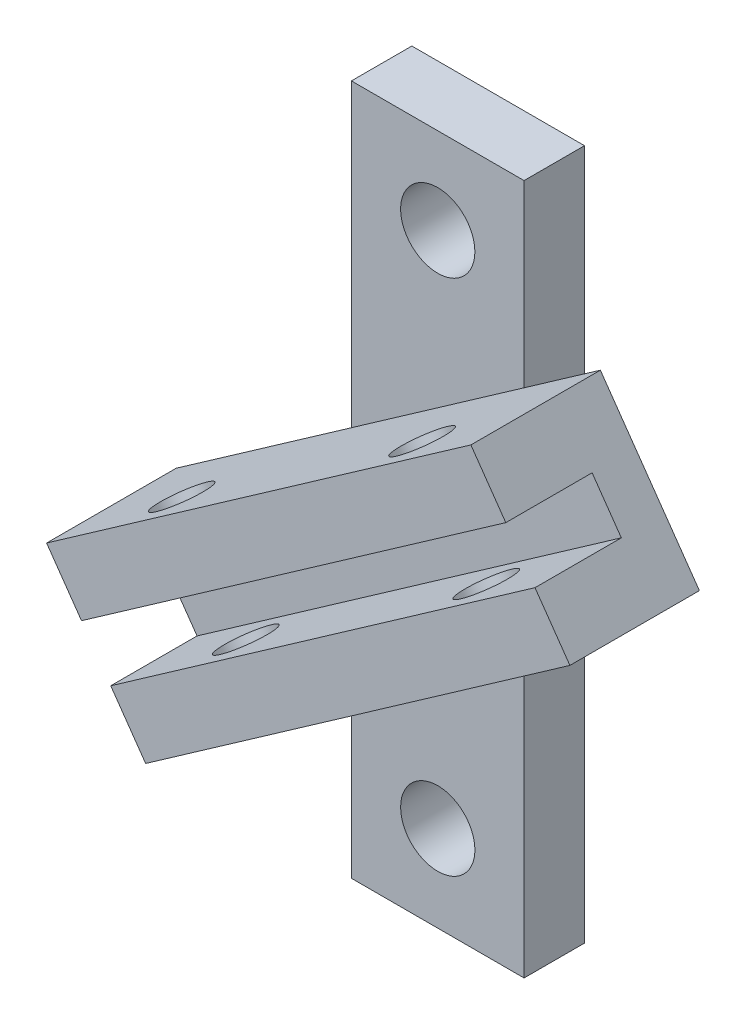
ISO-10303-21;
HEADER;
FILE_DESCRIPTION(('STEP AP214'),'2;1');
FILE_NAME('part.step','',(''),(''),'','','');
FILE_SCHEMA(('AUTOMOTIVE_DESIGN { 1 0 10303 214 1 1 1 1 }'));
ENDSEC;
DATA;
#1=APPLICATION_CONTEXT('core data for automotive mechanical design processes');
#2=APPLICATION_PROTOCOL_DEFINITION('international standard','automotive_design',2000,#1);
#3=PRODUCT_CONTEXT('',#1,'mechanical');
#4=PRODUCT('Part','Part','',(#3));
#5=PRODUCT_RELATED_PRODUCT_CATEGORY('part','',(#4));
#6=PRODUCT_DEFINITION_FORMATION('','',#4);
#7=PRODUCT_DEFINITION_CONTEXT('part definition',#1,'design');
#8=PRODUCT_DEFINITION('design','',#6,#7);
#9=PRODUCT_DEFINITION_SHAPE('','',#8);
#10=(LENGTH_UNIT() NAMED_UNIT(*) SI_UNIT(.MILLI.,.METRE.));
#11=(NAMED_UNIT(*) PLANE_ANGLE_UNIT() SI_UNIT($,.RADIAN.));
#12=(NAMED_UNIT(*) SI_UNIT($,.STERADIAN.) SOLID_ANGLE_UNIT());
#13=UNCERTAINTY_MEASURE_WITH_UNIT(LENGTH_MEASURE(1.E-05),#10,'distance_accuracy_value','');
#14=(GEOMETRIC_REPRESENTATION_CONTEXT(3) GLOBAL_UNCERTAINTY_ASSIGNED_CONTEXT((#13)) GLOBAL_UNIT_ASSIGNED_CONTEXT((#10,
#11,#12)) REPRESENTATION_CONTEXT('',''));
#15=CARTESIAN_POINT('',(0.,0.,0.));
#16=DIRECTION('',(0.,0.,1.));
#17=DIRECTION('',(1.,0.,0.));
#18=AXIS2_PLACEMENT_3D('',#15,#16,#17);
#19=CARTESIAN_POINT('',(0.,0.,22.));
#20=DIRECTION('',(0.,0.,1.));
#21=DIRECTION('',(1.,0.,0.));
#22=AXIS2_PLACEMENT_3D('',#19,#20,#21);
#23=PLANE('',#22);
#24=DIRECTION('',(-0.819152044288995,-0.573576436351042,0.));
#25=VECTOR('',#24,1.);
#26=CARTESIAN_POINT('',(32.8825108414343,59.6237916211837,22.));
#27=LINE('',#26,#25);
#28=CARTESIAN_POINT('',(32.8825108414343,59.6237916211837,22.));
#29=VERTEX_POINT('',#28);
#30=CARTESIAN_POINT('',(-16.2666118159054,25.2092054401212,22.));
#31=VERTEX_POINT('',#30);
#32=EDGE_CURVE('E154',#29,#31,#27,.T.);
#33=ORIENTED_EDGE('',*,*,#32,.F.);
#34=DIRECTION('',(-0.573576436351042,0.819152044288995,0.));
#35=VECTOR('',#34,1.);
#36=CARTESIAN_POINT('',(50.0785144610163,35.0653533279472,22.));
#37=LINE('',#36,#35);
#38=CARTESIAN_POINT('',(28.8387969651595,65.3988135334211,22.));
#39=VERTEX_POINT('',#38);
#40=EDGE_CURVE('E175',#29,#39,#37,.T.);
#41=ORIENTED_EDGE('',*,*,#40,.T.);
#42=DIRECTION('',(-0.819152044288995,-0.573576436351042,0.));
#43=VECTOR('',#42,1.);
#44=CARTESIAN_POINT('',(-21.2397174958569,30.3334602054739,22.));
#45=LINE('',#44,#43);
#46=CARTESIAN_POINT('',(-20.3103256921802,30.9842273523586,22.));
#47=VERTEX_POINT('',#46);
#48=EDGE_CURVE('E166',#39,#47,#45,.T.);
#49=ORIENTED_EDGE('',*,*,#48,.T.);
#50=DIRECTION('',(0.573576436351042,-0.819152044288995,0.));
#51=VECTOR('',#50,1.);
#52=CARTESIAN_POINT('',(0.929391803676648,0.650767146884701,22.));
#53=LINE('',#52,#51);
#54=EDGE_CURVE('E170',#47,#31,#53,.T.);
#55=ORIENTED_EDGE('',*,*,#54,.T.);
#56=EDGE_LOOP('',(#33,#41,#49,#55));
#57=FACE_BOUND('',#56,.T.);
#58=ADVANCED_FACE('F35',(#57),#23,.T.);
#59=CARTESIAN_POINT('',(0.,0.,7.));
#60=DIRECTION('',(0.,0.,-1.));
#61=DIRECTION('',(-1.,0.,0.));
#62=AXIS2_PLACEMENT_3D('',#59,#60,#61);
#63=PLANE('',#62);
#64=CARTESIAN_POINT('',(9.99999999999999,70.,7.));
#65=DIRECTION('',(0.,0.,1.));
#66=DIRECTION('',(1.,0.,0.));
#67=AXIS2_PLACEMENT_3D('',#64,#65,#66);
#68=CIRCLE('',#67,4.3);
#69=CARTESIAN_POINT('',(14.3,70.,7.));
#70=VERTEX_POINT('',#69);
#71=EDGE_CURVE('E206',#70,#70,#68,.T.);
#72=ORIENTED_EDGE('',*,*,#71,.F.);
#73=EDGE_LOOP('',(#72));
#74=FACE_BOUND('',#73,.T.);
#75=DIRECTION('',(-0.819152044288995,-0.573576436351042,0.));
#76=VECTOR('',#75,1.);
#77=CARTESIAN_POINT('',(-21.2397174958569,30.3334602054739,7.));
#78=LINE('',#77,#76);
#79=CARTESIAN_POINT('',(20.,59.2098212697114,7.));
#80=VERTEX_POINT('',#79);
#81=CARTESIAN_POINT('',(0.,45.2056705055174,7.));
#82=VERTEX_POINT('',#81);
#83=EDGE_CURVE('E11',#80,#82,#78,.T.);
#84=ORIENTED_EDGE('',*,*,#83,.F.);
#85=DIRECTION('',(0.,1.,0.));
#86=VECTOR('',#85,1.);
#87=CARTESIAN_POINT('',(20.,0.,7.));
#88=LINE('',#87,#86);
#89=CARTESIAN_POINT('',(20.,80.,7.));
#90=VERTEX_POINT('',#89);
#91=EDGE_CURVE('E218',#80,#90,#88,.T.);
#92=ORIENTED_EDGE('',*,*,#91,.T.);
#93=DIRECTION('',(-1.,0.,0.));
#94=VECTOR('',#93,1.);
#95=CARTESIAN_POINT('',(0.,80.,7.));
#96=LINE('',#95,#94);
#97=CARTESIAN_POINT('',(0.,80.,7.));
#98=VERTEX_POINT('',#97);
#99=EDGE_CURVE('E221',#90,#98,#96,.T.);
#100=ORIENTED_EDGE('',*,*,#99,.T.);
#101=DIRECTION('',(0.,-1.,0.));
#102=VECTOR('',#101,1.);
#103=CARTESIAN_POINT('',(0.,0.,7.));
#104=LINE('',#103,#102);
#105=EDGE_CURVE('E212',#98,#82,#104,.T.);
#106=ORIENTED_EDGE('',*,*,#105,.T.);
#107=EDGE_LOOP('',(#84,#92,#100,#106));
#108=FACE_BOUND('',#107,.T.);
#109=ADVANCED_FACE('F327',(#74,#108),#63,.F.);
#110=CARTESIAN_POINT('',(10.,9.99999999999999,7.));
#111=DIRECTION('',(0.,0.,1.));
#112=DIRECTION('',(-1.,0.,0.));
#113=AXIS2_PLACEMENT_3D('',#110,#111,#112);
#114=CIRCLE('',#113,4.3);
#115=CARTESIAN_POINT('',(5.70000000000001,9.99999999999999,7.));
#116=VERTEX_POINT('',#115);
#117=EDGE_CURVE('E200',#116,#116,#114,.T.);
#118=ORIENTED_EDGE('',*,*,#117,.F.);
#119=EDGE_LOOP('',(#118));
#120=FACE_BOUND('',#119,.T.);
#121=DIRECTION('',(0.819152044288995,0.573576436351042,0.));
#122=VECTOR('',#121,1.);
#123=CARTESIAN_POINT('',(-9.76818876883604,13.9504193196941,7.));
#124=LINE('',#123,#122);
#125=CARTESIAN_POINT('',(0.,20.7901787302884,7.));
#126=VERTEX_POINT('',#125);
#127=CARTESIAN_POINT('',(20.,34.7943294944824,7.));
#128=VERTEX_POINT('',#127);
#129=EDGE_CURVE('E44',#126,#128,#124,.T.);
#130=ORIENTED_EDGE('',*,*,#129,.F.);
#131=CARTESIAN_POINT('',(0.,0.,7.));
#132=VERTEX_POINT('',#131);
#133=EDGE_CURVE('E216',#126,#132,#104,.T.);
#134=ORIENTED_EDGE('',*,*,#133,.T.);
#135=DIRECTION('',(1.,0.,0.));
#136=VECTOR('',#135,1.);
#137=CARTESIAN_POINT('',(0.,0.,7.));
#138=LINE('',#137,#136);
#139=CARTESIAN_POINT('',(20.,0.,7.));
#140=VERTEX_POINT('',#139);
#141=EDGE_CURVE('E214',#132,#140,#138,.T.);
#142=ORIENTED_EDGE('',*,*,#141,.T.);
#143=EDGE_CURVE('E219',#140,#128,#88,.T.);
#144=ORIENTED_EDGE('',*,*,#143,.T.);
#145=EDGE_LOOP('',(#130,#134,#142,#144));
#146=FACE_BOUND('',#145,.T.);
#147=ADVANCED_FACE('F332',(#120,#146),#63,.F.);
#148=CARTESIAN_POINT('',(0.,0.,0.));
#149=DIRECTION('',(0.,0.,-1.));
#150=DIRECTION('',(-1.,0.,0.));
#151=AXIS2_PLACEMENT_3D('',#148,#149,#150);
#152=PLANE('',#151);
#153=CARTESIAN_POINT('',(9.99999999999999,70.,0.));
#154=DIRECTION('',(0.,0.,1.));
#155=DIRECTION('',(1.,0.,0.));
#156=AXIS2_PLACEMENT_3D('',#153,#154,#155);
#157=CIRCLE('',#156,4.3);
#158=CARTESIAN_POINT('',(14.3,70.,0.));
#159=VERTEX_POINT('',#158);
#160=EDGE_CURVE('E203',#159,#159,#157,.T.);
#161=ORIENTED_EDGE('',*,*,#160,.T.);
#162=EDGE_LOOP('',(#161));
#163=FACE_BOUND('',#162,.T.);
#164=DIRECTION('',(0.,-1.,0.));
#165=VECTOR('',#164,1.);
#166=CARTESIAN_POINT('',(0.,0.,0.));
#167=LINE('',#166,#165);
#168=CARTESIAN_POINT('',(0.,80.,0.));
#169=VERTEX_POINT('',#168);
#170=CARTESIAN_POINT('',(0.,0.,0.));
#171=VERTEX_POINT('',#170);
#172=EDGE_CURVE('E209',#169,#171,#167,.T.);
#173=ORIENTED_EDGE('',*,*,#172,.F.);
#174=DIRECTION('',(-1.,0.,0.));
#175=VECTOR('',#174,1.);
#176=CARTESIAN_POINT('',(0.,80.,0.));
#177=LINE('',#176,#175);
#178=CARTESIAN_POINT('',(20.,80.,0.));
#179=VERTEX_POINT('',#178);
#180=EDGE_CURVE('E231',#179,#169,#177,.T.);
#181=ORIENTED_EDGE('',*,*,#180,.F.);
#182=DIRECTION('',(0.,1.,0.));
#183=VECTOR('',#182,1.);
#184=CARTESIAN_POINT('',(20.,0.,0.));
#185=LINE('',#184,#183);
#186=CARTESIAN_POINT('',(20.,0.,0.));
#187=VERTEX_POINT('',#186);
#188=EDGE_CURVE('E229',#187,#179,#185,.T.);
#189=ORIENTED_EDGE('',*,*,#188,.F.);
#190=DIRECTION('',(1.,0.,0.));
#191=VECTOR('',#190,1.);
#192=CARTESIAN_POINT('',(0.,0.,0.));
#193=LINE('',#192,#191);
#194=EDGE_CURVE('E227',#171,#187,#193,.T.);
#195=ORIENTED_EDGE('',*,*,#194,.F.);
#196=EDGE_LOOP('',(#173,#181,#189,#195));
#197=FACE_BOUND('',#196,.T.);
#198=CARTESIAN_POINT('',(10.,9.99999999999999,0.));
#199=DIRECTION('',(0.,0.,1.));
#200=DIRECTION('',(-1.,0.,0.));
#201=AXIS2_PLACEMENT_3D('',#198,#199,#200);
#202=CIRCLE('',#201,4.3);
#203=CARTESIAN_POINT('',(5.70000000000001,9.99999999999999,0.));
#204=VERTEX_POINT('',#203);
#205=EDGE_CURVE('E199',#204,#204,#202,.T.);
#206=ORIENTED_EDGE('',*,*,#205,.T.);
#207=EDGE_LOOP('',(#206));
#208=FACE_BOUND('',#207,.T.);
#209=ADVANCED_FACE('F364',(#163,#197,#208),#152,.T.);
#210=CARTESIAN_POINT('',(0.,0.,7.));
#211=DIRECTION('',(1.,0.,0.));
#212=DIRECTION('',(0.,0.,-1.));
#213=AXIS2_PLACEMENT_3D('',#210,#211,#212);
#214=PLANE('',#213);
#215=ORIENTED_EDGE('',*,*,#172,.T.);
#216=DIRECTION('',(0.,0.,-1.));
#217=VECTOR('',#216,1.);
#218=CARTESIAN_POINT('',(0.,0.,7.));
#219=LINE('',#218,#217);
#220=EDGE_CURVE('E240',#132,#171,#219,.T.);
#221=ORIENTED_EDGE('',*,*,#220,.F.);
#222=ORIENTED_EDGE('',*,*,#133,.F.);
#223=EDGE_CURVE('E215',#82,#126,#104,.T.);
#224=ORIENTED_EDGE('',*,*,#223,.F.);
#225=ORIENTED_EDGE('',*,*,#105,.F.);
#226=DIRECTION('',(0.,0.,-1.));
#227=VECTOR('',#226,1.);
#228=CARTESIAN_POINT('',(0.,80.,7.));
#229=LINE('',#228,#227);
#230=EDGE_CURVE('E224',#98,#169,#229,.T.);
#231=ORIENTED_EDGE('',*,*,#230,.T.);
#232=EDGE_LOOP('',(#215,#221,#222,#224,#225,#231));
#233=FACE_BOUND('',#232,.T.);
#234=ADVANCED_FACE('F37',(#233),#214,.F.);
#235=CARTESIAN_POINT('',(0.,0.,7.));
#236=DIRECTION('',(0.,1.,0.));
#237=DIRECTION('',(0.,0.,1.));
#238=AXIS2_PLACEMENT_3D('',#235,#236,#237);
#239=PLANE('',#238);
#240=ORIENTED_EDGE('',*,*,#194,.T.);
#241=DIRECTION('',(0.,0.,-1.));
#242=VECTOR('',#241,1.);
#243=CARTESIAN_POINT('',(20.,0.,7.));
#244=LINE('',#243,#242);
#245=EDGE_CURVE('E238',#140,#187,#244,.T.);
#246=ORIENTED_EDGE('',*,*,#245,.F.);
#247=ORIENTED_EDGE('',*,*,#141,.F.);
#248=ORIENTED_EDGE('',*,*,#220,.T.);
#249=EDGE_LOOP('',(#240,#246,#247,#248));
#250=FACE_BOUND('',#249,.T.);
#251=ADVANCED_FACE('F373',(#250),#239,.F.);
#252=CARTESIAN_POINT('',(20.,0.,7.));
#253=DIRECTION('',(-1.,0.,0.));
#254=DIRECTION('',(0.,-1.,0.));
#255=AXIS2_PLACEMENT_3D('',#252,#253,#254);
#256=PLANE('',#255);
#257=ORIENTED_EDGE('',*,*,#188,.T.);
#258=DIRECTION('',(0.,0.,-1.));
#259=VECTOR('',#258,1.);
#260=CARTESIAN_POINT('',(20.,80.,7.));
#261=LINE('',#260,#259);
#262=EDGE_CURVE('E235',#90,#179,#261,.T.);
#263=ORIENTED_EDGE('',*,*,#262,.F.);
#264=ORIENTED_EDGE('',*,*,#91,.F.);
#265=EDGE_CURVE('E222',#128,#80,#88,.T.);
#266=ORIENTED_EDGE('',*,*,#265,.F.);
#267=ORIENTED_EDGE('',*,*,#143,.F.);
#268=ORIENTED_EDGE('',*,*,#245,.T.);
#269=EDGE_LOOP('',(#257,#263,#264,#266,#267,#268));
#270=FACE_BOUND('',#269,.T.);
#271=ADVANCED_FACE('F370',(#270),#256,.F.);
#272=CARTESIAN_POINT('',(0.,80.,7.));
#273=DIRECTION('',(0.,-1.,0.));
#274=DIRECTION('',(0.,0.,-1.));
#275=AXIS2_PLACEMENT_3D('',#272,#273,#274);
#276=PLANE('',#275);
#277=ORIENTED_EDGE('',*,*,#180,.T.);
#278=ORIENTED_EDGE('',*,*,#230,.F.);
#279=ORIENTED_EDGE('',*,*,#99,.F.);
#280=ORIENTED_EDGE('',*,*,#262,.T.);
#281=EDGE_LOOP('',(#277,#278,#279,#280));
#282=FACE_BOUND('',#281,.T.);
#283=ADVANCED_FACE('F361',(#282),#276,.F.);
#284=CARTESIAN_POINT('',(9.99999999999999,70.,7.));
#285=DIRECTION('',(0.,0.,-1.));
#286=DIRECTION('',(-1.,0.,0.));
#287=AXIS2_PLACEMENT_3D('',#284,#285,#286);
#288=CYLINDRICAL_SURFACE('',#287,4.3);
#289=ORIENTED_EDGE('',*,*,#71,.T.);
#290=EDGE_LOOP('',(#289));
#291=FACE_BOUND('',#290,.T.);
#292=ORIENTED_EDGE('',*,*,#160,.F.);
#293=EDGE_LOOP('',(#292));
#294=FACE_BOUND('',#293,.T.);
#295=ADVANCED_FACE('F358',(#291,#294),#288,.F.);
#296=CARTESIAN_POINT('',(10.,9.99999999999999,7.));
#297=DIRECTION('',(0.,0.,-1.));
#298=DIRECTION('',(-1.,0.,0.));
#299=AXIS2_PLACEMENT_3D('',#296,#297,#298);
#300=CYLINDRICAL_SURFACE('',#299,4.3);
#301=ORIENTED_EDGE('',*,*,#117,.T.);
#302=EDGE_LOOP('',(#301));
#303=FACE_BOUND('',#302,.T.);
#304=ORIENTED_EDGE('',*,*,#205,.F.);
#305=EDGE_LOOP('',(#304));
#306=FACE_BOUND('',#305,.T.);
#307=ADVANCED_FACE('F355',(#303,#306),#300,.F.);
#308=CARTESIAN_POINT('',(0.,0.,7.));
#309=DIRECTION('',(0.,0.,1.));
#310=DIRECTION('',(1.,0.,0.));
#311=AXIS2_PLACEMENT_3D('',#308,#309,#310);
#312=PLANE('',#311);
#313=CARTESIAN_POINT('',(-20.3103256921802,30.9842273523586,7.));
#314=VERTEX_POINT('',#313);
#315=EDGE_CURVE('E47',#82,#314,#78,.T.);
#316=ORIENTED_EDGE('',*,*,#315,.F.);
#317=ORIENTED_EDGE('',*,*,#223,.T.);
#318=CARTESIAN_POINT('',(-8.83879696515939,14.6011864665788,7.));
#319=VERTEX_POINT('',#318);
#320=EDGE_CURVE('E184',#319,#126,#124,.T.);
#321=ORIENTED_EDGE('',*,*,#320,.F.);
#322=DIRECTION('',(0.573576436351042,-0.819152044288995,0.));
#323=VECTOR('',#322,1.);
#324=CARTESIAN_POINT('',(0.929391803676648,0.650767146884701,7.));
#325=LINE('',#324,#323);
#326=EDGE_CURVE('E181',#314,#319,#325,.T.);
#327=ORIENTED_EDGE('',*,*,#326,.F.);
#328=EDGE_LOOP('',(#316,#317,#321,#327));
#329=FACE_BOUND('',#328,.T.);
#330=ADVANCED_FACE('F282',(#329),#312,.F.);
#331=CARTESIAN_POINT('',(40.3103256921803,49.0157726476413,7.));
#332=VERTEX_POINT('',#331);
#333=EDGE_CURVE('E183',#128,#332,#124,.T.);
#334=ORIENTED_EDGE('',*,*,#333,.F.);
#335=ORIENTED_EDGE('',*,*,#265,.T.);
#336=CARTESIAN_POINT('',(28.8387969651595,65.3988135334211,7.));
#337=VERTEX_POINT('',#336);
#338=EDGE_CURVE('E46',#337,#80,#78,.T.);
#339=ORIENTED_EDGE('',*,*,#338,.F.);
#340=DIRECTION('',(-0.573576436351042,0.819152044288995,0.));
#341=VECTOR('',#340,1.);
#342=CARTESIAN_POINT('',(50.0785144610163,35.0653533279472,7.));
#343=LINE('',#342,#341);
#344=EDGE_CURVE('E169',#332,#337,#343,.T.);
#345=ORIENTED_EDGE('',*,*,#344,.F.);
#346=EDGE_LOOP('',(#334,#335,#339,#345));
#347=FACE_BOUND('',#346,.T.);
#348=ADVANCED_FACE('F260',(#347),#312,.F.);
#349=CARTESIAN_POINT('',(-21.2397174958569,30.3334602054739,22.));
#350=DIRECTION('',(0.573576436351042,-0.819152044288995,0.));
#351=DIRECTION('',(0.819152044288995,0.573576436351042,0.));
#352=AXIS2_PLACEMENT_3D('',#349,#350,#351);
#353=PLANE('',#352);
#354=CARTESIAN_POINT('',(18.1898203894025,57.9423198608576,17.));
#355=DIRECTION('',(-0.573576436351042,0.819152044288995,0.));
#356=DIRECTION('',(-0.819152044288995,-0.573576436351042,0.));
#357=AXIS2_PLACEMENT_3D('',#354,#355,#356);
#358=CIRCLE('',#357,2.99999999999999);
#359=CARTESIAN_POINT('',(15.7323642565356,56.2215905518045,17.));
#360=VERTEX_POINT('',#359);
#361=EDGE_CURVE('E304',#360,#360,#358,.T.);
#362=ORIENTED_EDGE('',*,*,#361,.F.);
#363=EDGE_LOOP('',(#362));
#364=FACE_BOUND('',#363,.T.);
#365=CARTESIAN_POINT('',(-9.66134911642328,38.4407210249222,17.));
#366=DIRECTION('',(-0.573576436351042,0.819152044288995,0.));
#367=DIRECTION('',(-0.819152044288995,-0.573576436351042,0.));
#368=AXIS2_PLACEMENT_3D('',#365,#366,#367);
#369=CIRCLE('',#368,2.99999999999999);
#370=CARTESIAN_POINT('',(-12.1188052492903,36.719991715869,17.));
#371=VERTEX_POINT('',#370);
#372=EDGE_CURVE('E295',#371,#371,#369,.T.);
#373=ORIENTED_EDGE('',*,*,#372,.F.);
#374=EDGE_LOOP('',(#373));
#375=FACE_BOUND('',#374,.T.);
#376=ORIENTED_EDGE('',*,*,#338,.T.);
#377=ORIENTED_EDGE('',*,*,#83,.T.);
#378=ORIENTED_EDGE('',*,*,#315,.T.);
#379=DIRECTION('',(0.,0.,-1.));
#380=VECTOR('',#379,1.);
#381=CARTESIAN_POINT('',(-20.3103256921802,30.9842273523586,22.));
#382=LINE('',#381,#380);
#383=EDGE_CURVE('E196',#47,#314,#382,.T.);
#384=ORIENTED_EDGE('',*,*,#383,.F.);
#385=ORIENTED_EDGE('',*,*,#48,.F.);
#386=DIRECTION('',(0.,0.,-1.));
#387=VECTOR('',#386,1.);
#388=CARTESIAN_POINT('',(28.8387969651595,65.3988135334211,22.));
#389=LINE('',#388,#387);
#390=EDGE_CURVE('E178',#39,#337,#389,.T.);
#391=ORIENTED_EDGE('',*,*,#390,.T.);
#392=EDGE_LOOP('',(#376,#377,#378,#384,#385,#391));
#393=FACE_BOUND('',#392,.T.);
#394=ADVANCED_FACE('F263',(#364,#375,#393),#353,.F.);
#395=CARTESIAN_POINT('',(0.929391803676648,0.650767146884701,22.));
#396=DIRECTION('',(0.819152044288995,0.573576436351042,0.));
#397=DIRECTION('',(-0.573576436351042,0.819152044288995,0.));
#398=AXIS2_PLACEMENT_3D('',#395,#396,#397);
#399=PLANE('',#398);
#400=DIRECTION('',(0.573576436351042,-0.819152044288995,0.));
#401=VECTOR('',#400,1.);
#402=CARTESIAN_POINT('',(-16.2666118159054,25.2092054401212,12.));
#403=LINE('',#402,#401);
#404=CARTESIAN_POINT('',(-16.2666118159054,25.2092054401212,12.));
#405=VERTEX_POINT('',#404);
#406=CARTESIAN_POINT('',(-12.8825108414342,20.3762083788161,12.));
#407=VERTEX_POINT('',#406);
#408=EDGE_CURVE('E145',#405,#407,#403,.T.);
#409=ORIENTED_EDGE('',*,*,#408,.F.);
#410=DIRECTION('',(0.,0.,1.));
#411=VECTOR('',#410,1.);
#412=CARTESIAN_POINT('',(-16.2666118159054,25.2092054401212,12.));
#413=LINE('',#412,#411);
#414=EDGE_CURVE('E275',#405,#31,#413,.T.);
#415=ORIENTED_EDGE('',*,*,#414,.T.);
#416=ORIENTED_EDGE('',*,*,#54,.F.);
#417=ORIENTED_EDGE('',*,*,#383,.T.);
#418=ORIENTED_EDGE('',*,*,#326,.T.);
#419=DIRECTION('',(0.,0.,-1.));
#420=VECTOR('',#419,1.);
#421=CARTESIAN_POINT('',(-8.83879696515939,14.6011864665788,22.));
#422=LINE('',#421,#420);
#423=CARTESIAN_POINT('',(-8.83879696515939,14.6011864665788,22.));
#424=VERTEX_POINT('',#423);
#425=EDGE_CURVE('E193',#424,#319,#422,.T.);
#426=ORIENTED_EDGE('',*,*,#425,.F.);
#427=CARTESIAN_POINT('',(-12.8825108414342,20.3762083788161,22.));
#428=VERTEX_POINT('',#427);
#429=EDGE_CURVE('E159',#428,#424,#53,.T.);
#430=ORIENTED_EDGE('',*,*,#429,.F.);
#431=DIRECTION('',(0.,0.,1.));
#432=VECTOR('',#431,1.);
#433=CARTESIAN_POINT('',(-12.8825108414342,20.3762083788161,12.));
#434=LINE('',#433,#432);
#435=EDGE_CURVE('E54',#407,#428,#434,.T.);
#436=ORIENTED_EDGE('',*,*,#435,.F.);
#437=EDGE_LOOP('',(#409,#415,#416,#417,#418,#426,#430,#436));
#438=FACE_BOUND('',#437,.T.);
#439=ADVANCED_FACE('F157',(#438),#399,.F.);
#440=CARTESIAN_POINT('',(-9.76818876883604,13.9504193196941,22.));
#441=DIRECTION('',(-0.573576436351042,0.819152044288995,0.));
#442=DIRECTION('',(-0.819152044288995,-0.573576436351042,0.));
#443=AXIS2_PLACEMENT_3D('',#440,#441,#442);
#444=PLANE('',#443);
#445=CARTESIAN_POINT('',(29.6613491164234,41.5592789750777,17.));
#446=DIRECTION('',(-0.573576436351042,0.819152044288995,0.));
#447=DIRECTION('',(-0.819152044288995,-0.573576436351042,0.));
#448=AXIS2_PLACEMENT_3D('',#445,#446,#447);
#449=CIRCLE('',#448,2.99999999999999);
#450=CARTESIAN_POINT('',(27.2038929835564,39.8385496660246,17.));
#451=VERTEX_POINT('',#450);
#452=EDGE_CURVE('E301',#451,#451,#449,.T.);
#453=ORIENTED_EDGE('',*,*,#452,.T.);
#454=EDGE_LOOP('',(#453));
#455=FACE_BOUND('',#454,.T.);
#456=CARTESIAN_POINT('',(1.81017961059753,22.0576801391423,17.));
#457=DIRECTION('',(-0.573576436351042,0.819152044288995,0.));
#458=DIRECTION('',(-0.819152044288995,-0.573576436351042,0.));
#459=AXIS2_PLACEMENT_3D('',#456,#457,#458);
#460=CIRCLE('',#459,2.99999999999999);
#461=CARTESIAN_POINT('',(-0.647276522269444,20.3369508300892,17.));
#462=VERTEX_POINT('',#461);
#463=EDGE_CURVE('E289',#462,#462,#460,.T.);
#464=ORIENTED_EDGE('',*,*,#463,.T.);
#465=EDGE_LOOP('',(#464));
#466=FACE_BOUND('',#465,.T.);
#467=ORIENTED_EDGE('',*,*,#320,.T.);
#468=ORIENTED_EDGE('',*,*,#129,.T.);
#469=ORIENTED_EDGE('',*,*,#333,.T.);
#470=DIRECTION('',(0.,0.,-1.));
#471=VECTOR('',#470,1.);
#472=CARTESIAN_POINT('',(40.3103256921803,49.0157726476413,22.));
#473=LINE('',#472,#471);
#474=CARTESIAN_POINT('',(40.3103256921803,49.0157726476413,22.));
#475=VERTEX_POINT('',#474);
#476=EDGE_CURVE('E190',#475,#332,#473,.T.);
#477=ORIENTED_EDGE('',*,*,#476,.F.);
#478=DIRECTION('',(0.819152044288995,0.573576436351042,0.));
#479=VECTOR('',#478,1.);
#480=CARTESIAN_POINT('',(-9.76818876883604,13.9504193196941,22.));
#481=LINE('',#480,#479);
#482=EDGE_CURVE('E173',#424,#475,#481,.T.);
#483=ORIENTED_EDGE('',*,*,#482,.F.);
#484=ORIENTED_EDGE('',*,*,#425,.T.);
#485=EDGE_LOOP('',(#467,#468,#469,#477,#483,#484));
#486=FACE_BOUND('',#485,.T.);
#487=ADVANCED_FACE('F249',(#455,#466,#486),#444,.F.);
#488=CARTESIAN_POINT('',(50.0785144610163,35.0653533279472,22.));
#489=DIRECTION('',(-0.819152044288995,-0.573576436351042,0.));
#490=DIRECTION('',(0.573576436351042,-0.819152044288995,0.));
#491=AXIS2_PLACEMENT_3D('',#488,#489,#490);
#492=PLANE('',#491);
#493=ORIENTED_EDGE('',*,*,#40,.F.);
#494=DIRECTION('',(0.,0.,1.));
#495=VECTOR('',#494,1.);
#496=CARTESIAN_POINT('',(32.8825108414343,59.6237916211837,12.));
#497=LINE('',#496,#495);
#498=CARTESIAN_POINT('',(32.8825108414343,59.6237916211837,12.));
#499=VERTEX_POINT('',#498);
#500=EDGE_CURVE('E161',#499,#29,#497,.T.);
#501=ORIENTED_EDGE('',*,*,#500,.F.);
#502=DIRECTION('',(-0.573576436351043,0.819152044288994,0.));
#503=VECTOR('',#502,1.);
#504=CARTESIAN_POINT('',(36.2666118159055,54.7907945598786,12.));
#505=LINE('',#504,#503);
#506=CARTESIAN_POINT('',(36.2666118159055,54.7907945598786,12.));
#507=VERTEX_POINT('',#506);
#508=EDGE_CURVE('E144',#507,#499,#505,.T.);
#509=ORIENTED_EDGE('',*,*,#508,.F.);
#510=DIRECTION('',(0.,0.,1.));
#511=VECTOR('',#510,1.);
#512=CARTESIAN_POINT('',(36.2666118159055,54.7907945598786,12.));
#513=LINE('',#512,#511);
#514=CARTESIAN_POINT('',(36.2666118159055,54.7907945598786,22.));
#515=VERTEX_POINT('',#514);
#516=EDGE_CURVE('E141',#507,#515,#513,.T.);
#517=ORIENTED_EDGE('',*,*,#516,.T.);
#518=EDGE_CURVE('E176',#475,#515,#37,.T.);
#519=ORIENTED_EDGE('',*,*,#518,.F.);
#520=ORIENTED_EDGE('',*,*,#476,.T.);
#521=ORIENTED_EDGE('',*,*,#344,.T.);
#522=ORIENTED_EDGE('',*,*,#390,.F.);
#523=EDGE_LOOP('',(#493,#501,#509,#517,#519,#520,#521,#522));
#524=FACE_BOUND('',#523,.T.);
#525=ADVANCED_FACE('F257',(#524),#492,.F.);
#526=DIRECTION('',(0.819152044288995,0.573576436351042,0.));
#527=VECTOR('',#526,1.);
#528=CARTESIAN_POINT('',(-12.8825108414342,20.3762083788161,22.));
#529=LINE('',#528,#527);
#530=EDGE_CURVE('E270',#428,#515,#529,.T.);
#531=ORIENTED_EDGE('',*,*,#530,.F.);
#532=ORIENTED_EDGE('',*,*,#429,.T.);
#533=ORIENTED_EDGE('',*,*,#482,.T.);
#534=ORIENTED_EDGE('',*,*,#518,.T.);
#535=EDGE_LOOP('',(#531,#532,#533,#534));
#536=FACE_BOUND('',#535,.T.);
#537=ADVANCED_FACE('F284',(#536),#23,.T.);
#538=CARTESIAN_POINT('',(32.8825108414343,59.6237916211837,12.));
#539=DIRECTION('',(-0.573576436351042,0.819152044288995,0.));
#540=DIRECTION('',(-0.819152044288995,-0.573576436351042,0.));
#541=AXIS2_PLACEMENT_3D('',#538,#539,#540);
#542=PLANE('',#541);
#543=CARTESIAN_POINT('',(22.2335342656774,52.1672979486202,17.));
#544=DIRECTION('',(-0.573576436351042,0.819152044288995,0.));
#545=DIRECTION('',(-0.819152044288995,-0.573576436351042,0.));
#546=AXIS2_PLACEMENT_3D('',#543,#544,#545);
#547=CIRCLE('',#546,2.99999999999999);
#548=CARTESIAN_POINT('',(19.7760781328104,50.4465686395671,17.));
#549=VERTEX_POINT('',#548);
#550=EDGE_CURVE('E39',#549,#549,#547,.T.);
#551=ORIENTED_EDGE('',*,*,#550,.T.);
#552=EDGE_LOOP('',(#551));
#553=FACE_BOUND('',#552,.T.);
#554=CARTESIAN_POINT('',(-5.61763524014846,32.6656991126848,17.));
#555=DIRECTION('',(-0.573576436351042,0.819152044288995,0.));
#556=DIRECTION('',(-0.819152044288995,-0.573576436351042,0.));
#557=AXIS2_PLACEMENT_3D('',#554,#555,#556);
#558=CIRCLE('',#557,2.99999999999999);
#559=CARTESIAN_POINT('',(-8.07509137301544,30.9449698036317,17.));
#560=VERTEX_POINT('',#559);
#561=EDGE_CURVE('E292',#560,#560,#558,.T.);
#562=ORIENTED_EDGE('',*,*,#561,.T.);
#563=EDGE_LOOP('',(#562));
#564=FACE_BOUND('',#563,.T.);
#565=ORIENTED_EDGE('',*,*,#32,.T.);
#566=ORIENTED_EDGE('',*,*,#414,.F.);
#567=DIRECTION('',(-0.819152044288995,-0.573576436351042,0.));
#568=VECTOR('',#567,1.);
#569=CARTESIAN_POINT('',(32.8825108414343,59.6237916211837,12.));
#570=LINE('',#569,#568);
#571=EDGE_CURVE('E151',#499,#405,#570,.T.);
#572=ORIENTED_EDGE('',*,*,#571,.F.);
#573=ORIENTED_EDGE('',*,*,#500,.T.);
#574=EDGE_LOOP('',(#565,#566,#572,#573));
#575=FACE_BOUND('',#574,.T.);
#576=ADVANCED_FACE('F276',(#553,#564,#575),#542,.F.);
#577=CARTESIAN_POINT('',(-12.8825108414342,20.3762083788161,12.));
#578=DIRECTION('',(0.573576436351042,-0.819152044288995,0.));
#579=DIRECTION('',(0.819152044288995,0.573576436351042,0.));
#580=AXIS2_PLACEMENT_3D('',#577,#578,#579);
#581=PLANE('',#580);
#582=CARTESIAN_POINT('',(25.6176352401485,47.3343008873151,17.));
#583=DIRECTION('',(0.573576436351042,-0.819152044288995,0.));
#584=DIRECTION('',(0.819152044288995,0.573576436351042,0.));
#585=AXIS2_PLACEMENT_3D('',#582,#583,#584);
#586=CIRCLE('',#585,2.99999999999999);
#587=CARTESIAN_POINT('',(28.0750913730155,49.0550301963682,17.));
#588=VERTEX_POINT('',#587);
#589=EDGE_CURVE('E298',#588,#588,#586,.T.);
#590=ORIENTED_EDGE('',*,*,#589,.T.);
#591=EDGE_LOOP('',(#590));
#592=FACE_BOUND('',#591,.T.);
#593=CARTESIAN_POINT('',(-2.23353426567729,27.8327020513797,17.));
#594=DIRECTION('',(0.573576436351042,-0.819152044288995,0.));
#595=DIRECTION('',(0.819152044288995,0.573576436351042,0.));
#596=AXIS2_PLACEMENT_3D('',#593,#594,#595);
#597=CIRCLE('',#596,2.99999999999999);
#598=CARTESIAN_POINT('',(0.223921867189685,29.5534313604328,17.));
#599=VERTEX_POINT('',#598);
#600=EDGE_CURVE('E272',#599,#599,#597,.T.);
#601=ORIENTED_EDGE('',*,*,#600,.T.);
#602=EDGE_LOOP('',(#601));
#603=FACE_BOUND('',#602,.T.);
#604=ORIENTED_EDGE('',*,*,#530,.T.);
#605=ORIENTED_EDGE('',*,*,#516,.F.);
#606=DIRECTION('',(0.819152044288995,0.573576436351042,0.));
#607=VECTOR('',#606,1.);
#608=CARTESIAN_POINT('',(-12.8825108414342,20.3762083788161,12.));
#609=LINE('',#608,#607);
#610=EDGE_CURVE('E137',#407,#507,#609,.T.);
#611=ORIENTED_EDGE('',*,*,#610,.F.);
#612=ORIENTED_EDGE('',*,*,#435,.T.);
#613=EDGE_LOOP('',(#604,#605,#611,#612));
#614=FACE_BOUND('',#613,.T.);
#615=ADVANCED_FACE('F139',(#592,#603,#614),#581,.F.);
#616=CARTESIAN_POINT('',(0.,0.,12.));
#617=DIRECTION('',(0.,0.,1.));
#618=DIRECTION('',(1.,0.,0.));
#619=AXIS2_PLACEMENT_3D('',#616,#617,#618);
#620=PLANE('',#619);
#621=ORIENTED_EDGE('',*,*,#408,.T.);
#622=ORIENTED_EDGE('',*,*,#610,.T.);
#623=ORIENTED_EDGE('',*,*,#508,.T.);
#624=ORIENTED_EDGE('',*,*,#571,.T.);
#625=EDGE_LOOP('',(#621,#622,#623,#624));
#626=FACE_BOUND('',#625,.T.);
#627=ADVANCED_FACE('F149',(#626),#620,.T.);
#628=CARTESIAN_POINT('',(-9.66134911642328,38.4407210249222,17.));
#629=DIRECTION('',(-0.573576436351042,0.819152044288995,0.));
#630=DIRECTION('',(-0.819152044288995,-0.573576436351042,0.));
#631=AXIS2_PLACEMENT_3D('',#628,#629,#630);
#632=CYLINDRICAL_SURFACE('',#631,2.99999999999999);
#633=ORIENTED_EDGE('',*,*,#372,.T.);
#634=EDGE_LOOP('',(#633));
#635=FACE_BOUND('',#634,.T.);
#636=ORIENTED_EDGE('',*,*,#561,.F.);
#637=EDGE_LOOP('',(#636));
#638=FACE_BOUND('',#637,.T.);
#639=ADVANCED_FACE('F323',(#635,#638),#632,.F.);
#640=ORIENTED_EDGE('',*,*,#463,.F.);
#641=EDGE_LOOP('',(#640));
#642=FACE_BOUND('',#641,.T.);
#643=ORIENTED_EDGE('',*,*,#600,.F.);
#644=EDGE_LOOP('',(#643));
#645=FACE_BOUND('',#644,.T.);
#646=ADVANCED_FACE('F316',(#642,#645),#632,.F.);
#647=CARTESIAN_POINT('',(18.1898203894025,57.9423198608576,17.));
#648=DIRECTION('',(-0.573576436351042,0.819152044288995,0.));
#649=DIRECTION('',(-0.819152044288995,-0.573576436351042,0.));
#650=AXIS2_PLACEMENT_3D('',#647,#648,#649);
#651=CYLINDRICAL_SURFACE('',#650,2.99999999999999);
#652=ORIENTED_EDGE('',*,*,#361,.T.);
#653=EDGE_LOOP('',(#652));
#654=FACE_BOUND('',#653,.T.);
#655=ORIENTED_EDGE('',*,*,#550,.F.);
#656=EDGE_LOOP('',(#655));
#657=FACE_BOUND('',#656,.T.);
#658=ADVANCED_FACE('F313',(#654,#657),#651,.F.);
#659=ORIENTED_EDGE('',*,*,#452,.F.);
#660=EDGE_LOOP('',(#659));
#661=FACE_BOUND('',#660,.T.);
#662=ORIENTED_EDGE('',*,*,#589,.F.);
#663=EDGE_LOOP('',(#662));
#664=FACE_BOUND('',#663,.T.);
#665=ADVANCED_FACE('F315',(#661,#664),#651,.F.);
#666=CLOSED_SHELL('',(#58,#109,#147,#209,#234,#251,#271,#283,#295,#307,#330,#348,#394,#439,#487,
#525,#537,#576,#615,#627,#639,#646,#658,#665));
#667=MANIFOLD_SOLID_BREP('B2',#666);
#668=ADVANCED_BREP_SHAPE_REPRESENTATION('',(#18,#667),#14);
#669=SHAPE_DEFINITION_REPRESENTATION(#9,#668);
ENDSEC;
END-ISO-10303-21;
